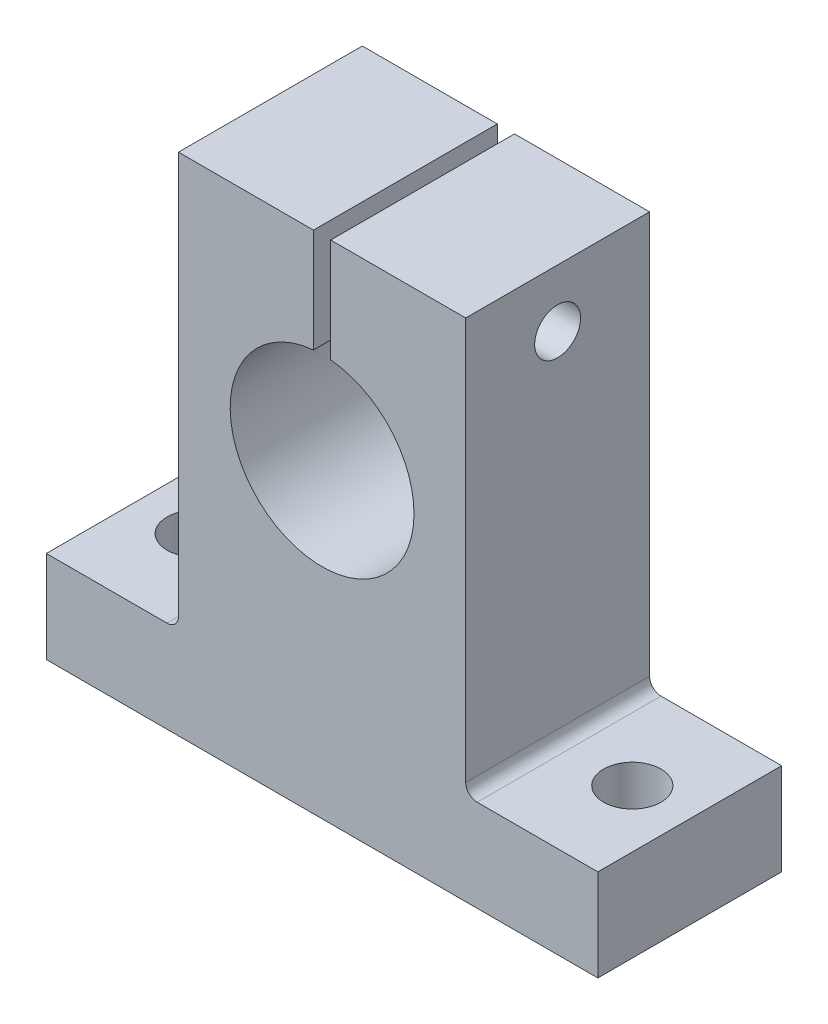
ISO-10303-21;
HEADER;
FILE_DESCRIPTION(('STEP AP214'),'2;1');
FILE_NAME('part.step','',(''),(''),'','','');
FILE_SCHEMA(('AUTOMOTIVE_DESIGN { 1 0 10303 214 1 1 1 1 }'));
ENDSEC;
DATA;
#1=APPLICATION_CONTEXT('core data for automotive mechanical design processes');
#2=APPLICATION_PROTOCOL_DEFINITION('international standard','automotive_design',2000,#1);
#3=PRODUCT_CONTEXT('',#1,'mechanical');
#4=PRODUCT('Part','Part','',(#3));
#5=PRODUCT_RELATED_PRODUCT_CATEGORY('part','',(#4));
#6=PRODUCT_DEFINITION_FORMATION('','',#4);
#7=PRODUCT_DEFINITION_CONTEXT('part definition',#1,'design');
#8=PRODUCT_DEFINITION('design','',#6,#7);
#9=PRODUCT_DEFINITION_SHAPE('','',#8);
#10=(LENGTH_UNIT() NAMED_UNIT(*) SI_UNIT(.MILLI.,.METRE.));
#11=(NAMED_UNIT(*) PLANE_ANGLE_UNIT() SI_UNIT($,.RADIAN.));
#12=(NAMED_UNIT(*) SI_UNIT($,.STERADIAN.) SOLID_ANGLE_UNIT());
#13=UNCERTAINTY_MEASURE_WITH_UNIT(LENGTH_MEASURE(1.E-05),#10,'distance_accuracy_value','');
#14=(GEOMETRIC_REPRESENTATION_CONTEXT(3) GLOBAL_UNCERTAINTY_ASSIGNED_CONTEXT((#13)) GLOBAL_UNIT_ASSIGNED_CONTEXT((#10,
#11,#12)) REPRESENTATION_CONTEXT('',''));
#15=CARTESIAN_POINT('',(0.,0.,0.));
#16=DIRECTION('',(0.,0.,1.));
#17=DIRECTION('',(1.,0.,0.));
#18=AXIS2_PLACEMENT_3D('',#15,#16,#17);
#19=CARTESIAN_POINT('',(24.,39.,0.));
#20=DIRECTION('',(-1.,0.,0.));
#21=DIRECTION('',(0.,-1.,0.));
#22=AXIS2_PLACEMENT_3D('',#19,#20,#21);
#23=CYLINDRICAL_SURFACE('',#22,2.);
#24=CARTESIAN_POINT('',(-0.750000000000001,39.,0.));
#25=DIRECTION('',(-1.,0.,0.));
#26=DIRECTION('',(0.,-1.,0.));
#27=AXIS2_PLACEMENT_3D('',#24,#25,#26);
#28=CIRCLE('',#27,2.);
#29=CARTESIAN_POINT('',(-0.750000000000001,37.,0.));
#30=VERTEX_POINT('',#29);
#31=EDGE_CURVE('E375',#30,#30,#28,.T.);
#32=ORIENTED_EDGE('',*,*,#31,.F.);
#33=EDGE_LOOP('',(#32));
#34=FACE_BOUND('',#33,.T.);
#35=CARTESIAN_POINT('',(-8.5,39.,0.));
#36=DIRECTION('',(-1.,0.,0.));
#37=DIRECTION('',(0.,-1.,0.));
#38=AXIS2_PLACEMENT_3D('',#35,#36,#37);
#39=CIRCLE('',#38,2.);
#40=CARTESIAN_POINT('',(-8.5,37.,0.));
#41=VERTEX_POINT('',#40);
#42=EDGE_CURVE('E36',#41,#41,#39,.F.);
#43=ORIENTED_EDGE('',*,*,#42,.F.);
#44=EDGE_LOOP('',(#43));
#45=FACE_BOUND('',#44,.T.);
#46=ADVANCED_FACE('F32',(#34,#45),#23,.F.);
#47=CARTESIAN_POINT('',(-24.,8.,8.));
#48=DIRECTION('',(1.,0.,0.));
#49=DIRECTION('',(0.,0.,-1.));
#50=AXIS2_PLACEMENT_3D('',#47,#48,#49);
#51=PLANE('',#50);
#52=DIRECTION('',(0.,-1.,0.));
#53=VECTOR('',#52,1.);
#54=CARTESIAN_POINT('',(-24.,8.,-8.));
#55=LINE('',#54,#53);
#56=CARTESIAN_POINT('',(-24.,8.,-8.));
#57=VERTEX_POINT('',#56);
#58=CARTESIAN_POINT('',(-24.,0.,-8.));
#59=VERTEX_POINT('',#58);
#60=EDGE_CURVE('E158',#57,#59,#55,.T.);
#61=ORIENTED_EDGE('',*,*,#60,.T.);
#62=DIRECTION('',(0.,0.,-1.));
#63=VECTOR('',#62,1.);
#64=CARTESIAN_POINT('',(-24.,0.,8.));
#65=LINE('',#64,#63);
#66=CARTESIAN_POINT('',(-24.,0.,8.));
#67=VERTEX_POINT('',#66);
#68=EDGE_CURVE('E138',#67,#59,#65,.T.);
#69=ORIENTED_EDGE('',*,*,#68,.F.);
#70=DIRECTION('',(0.,-1.,0.));
#71=VECTOR('',#70,1.);
#72=CARTESIAN_POINT('',(-24.,8.,8.));
#73=LINE('',#72,#71);
#74=CARTESIAN_POINT('',(-24.,8.,8.));
#75=VERTEX_POINT('',#74);
#76=EDGE_CURVE('E145',#75,#67,#73,.T.);
#77=ORIENTED_EDGE('',*,*,#76,.F.);
#78=DIRECTION('',(0.,0.,-1.));
#79=VECTOR('',#78,1.);
#80=CARTESIAN_POINT('',(-24.,8.,8.));
#81=LINE('',#80,#79);
#82=EDGE_CURVE('E187',#75,#57,#81,.T.);
#83=ORIENTED_EDGE('',*,*,#82,.T.);
#84=EDGE_LOOP('',(#61,#69,#77,#83));
#85=FACE_BOUND('',#84,.T.);
#86=ADVANCED_FACE('F156',(#85),#51,.F.);
#87=CARTESIAN_POINT('',(-24.,0.,8.));
#88=DIRECTION('',(0.,1.,0.));
#89=DIRECTION('',(0.,0.,1.));
#90=AXIS2_PLACEMENT_3D('',#87,#88,#89);
#91=PLANE('',#90);
#92=CARTESIAN_POINT('',(19.,0.,0.));
#93=DIRECTION('',(0.,1.,0.));
#94=DIRECTION('',(-1.,0.,0.));
#95=AXIS2_PLACEMENT_3D('',#92,#93,#94);
#96=CIRCLE('',#95,2.5);
#97=CARTESIAN_POINT('',(16.5,0.,0.));
#98=VERTEX_POINT('',#97);
#99=EDGE_CURVE('E357',#98,#98,#96,.T.);
#100=ORIENTED_EDGE('',*,*,#99,.T.);
#101=EDGE_LOOP('',(#100));
#102=FACE_BOUND('',#101,.T.);
#103=CARTESIAN_POINT('',(-19.,0.,0.));
#104=DIRECTION('',(0.,1.,0.));
#105=DIRECTION('',(-1.,0.,0.));
#106=AXIS2_PLACEMENT_3D('',#103,#104,#105);
#107=CIRCLE('',#106,2.5);
#108=CARTESIAN_POINT('',(-21.5,0.,0.));
#109=VERTEX_POINT('',#108);
#110=EDGE_CURVE('E261',#109,#109,#107,.T.);
#111=ORIENTED_EDGE('',*,*,#110,.T.);
#112=EDGE_LOOP('',(#111));
#113=FACE_BOUND('',#112,.T.);
#114=DIRECTION('',(1.,0.,0.));
#115=VECTOR('',#114,1.);
#116=CARTESIAN_POINT('',(-24.,0.,-8.));
#117=LINE('',#116,#115);
#118=CARTESIAN_POINT('',(24.,0.,-8.));
#119=VERTEX_POINT('',#118);
#120=EDGE_CURVE('E235',#59,#119,#117,.T.);
#121=ORIENTED_EDGE('',*,*,#120,.T.);
#122=DIRECTION('',(0.,0.,-1.));
#123=VECTOR('',#122,1.);
#124=CARTESIAN_POINT('',(24.,0.,8.));
#125=LINE('',#124,#123);
#126=CARTESIAN_POINT('',(24.,0.,8.));
#127=VERTEX_POINT('',#126);
#128=EDGE_CURVE('E141',#127,#119,#125,.T.);
#129=ORIENTED_EDGE('',*,*,#128,.F.);
#130=DIRECTION('',(1.,0.,0.));
#131=VECTOR('',#130,1.);
#132=CARTESIAN_POINT('',(-24.,0.,8.));
#133=LINE('',#132,#131);
#134=EDGE_CURVE('E134',#67,#127,#133,.T.);
#135=ORIENTED_EDGE('',*,*,#134,.F.);
#136=ORIENTED_EDGE('',*,*,#68,.T.);
#137=EDGE_LOOP('',(#121,#129,#135,#136));
#138=FACE_BOUND('',#137,.T.);
#139=ADVANCED_FACE('F136',(#102,#113,#138),#91,.F.);
#140=CARTESIAN_POINT('',(24.,0.,8.));
#141=DIRECTION('',(-1.,0.,0.));
#142=DIRECTION('',(0.,0.,1.));
#143=AXIS2_PLACEMENT_3D('',#140,#141,#142);
#144=PLANE('',#143);
#145=DIRECTION('',(0.,1.,0.));
#146=VECTOR('',#145,1.);
#147=CARTESIAN_POINT('',(24.,0.,-8.));
#148=LINE('',#147,#146);
#149=CARTESIAN_POINT('',(24.,8.,-8.));
#150=VERTEX_POINT('',#149);
#151=EDGE_CURVE('E230',#119,#150,#148,.T.);
#152=ORIENTED_EDGE('',*,*,#151,.T.);
#153=DIRECTION('',(0.,0.,-1.));
#154=VECTOR('',#153,1.);
#155=CARTESIAN_POINT('',(24.,8.,8.));
#156=LINE('',#155,#154);
#157=CARTESIAN_POINT('',(24.,8.,8.));
#158=VERTEX_POINT('',#157);
#159=EDGE_CURVE('E164',#158,#150,#156,.T.);
#160=ORIENTED_EDGE('',*,*,#159,.F.);
#161=DIRECTION('',(0.,1.,0.));
#162=VECTOR('',#161,1.);
#163=CARTESIAN_POINT('',(24.,0.,8.));
#164=LINE('',#163,#162);
#165=EDGE_CURVE('E144',#127,#158,#164,.T.);
#166=ORIENTED_EDGE('',*,*,#165,.F.);
#167=ORIENTED_EDGE('',*,*,#128,.T.);
#168=EDGE_LOOP('',(#152,#160,#166,#167));
#169=FACE_BOUND('',#168,.T.);
#170=ADVANCED_FACE('F262',(#169),#144,.F.);
#171=CARTESIAN_POINT('',(24.,8.,8.));
#172=DIRECTION('',(0.,-1.,0.));
#173=DIRECTION('',(1.,0.,0.));
#174=AXIS2_PLACEMENT_3D('',#171,#172,#173);
#175=PLANE('',#174);
#176=CARTESIAN_POINT('',(19.,8.00000000000001,0.));
#177=DIRECTION('',(0.,1.,0.));
#178=DIRECTION('',(-1.,0.,0.));
#179=AXIS2_PLACEMENT_3D('',#176,#177,#178);
#180=CIRCLE('',#179,2.5);
#181=CARTESIAN_POINT('',(16.5,8.00000000000001,0.));
#182=VERTEX_POINT('',#181);
#183=EDGE_CURVE('E365',#182,#182,#180,.T.);
#184=ORIENTED_EDGE('',*,*,#183,.F.);
#185=EDGE_LOOP('',(#184));
#186=FACE_BOUND('',#185,.T.);
#187=DIRECTION('',(-1.,0.,0.));
#188=VECTOR('',#187,1.);
#189=CARTESIAN_POINT('',(24.,8.,-8.));
#190=LINE('',#189,#188);
#191=CARTESIAN_POINT('',(13.5,8.,-8.));
#192=VERTEX_POINT('',#191);
#193=EDGE_CURVE('E226',#150,#192,#190,.T.);
#194=ORIENTED_EDGE('',*,*,#193,.T.);
#195=DIRECTION('',(0.,0.,-1.));
#196=VECTOR('',#195,1.);
#197=CARTESIAN_POINT('',(13.5,8.,8.));
#198=LINE('',#197,#196);
#199=CARTESIAN_POINT('',(13.5,8.,8.));
#200=VERTEX_POINT('',#199);
#201=EDGE_CURVE('E48',#192,#200,#198,.F.);
#202=ORIENTED_EDGE('',*,*,#201,.T.);
#203=DIRECTION('',(-1.,0.,0.));
#204=VECTOR('',#203,1.);
#205=CARTESIAN_POINT('',(24.,8.,8.));
#206=LINE('',#205,#204);
#207=EDGE_CURVE('E227',#158,#200,#206,.T.);
#208=ORIENTED_EDGE('',*,*,#207,.F.);
#209=ORIENTED_EDGE('',*,*,#159,.T.);
#210=EDGE_LOOP('',(#194,#202,#208,#209));
#211=FACE_BOUND('',#210,.T.);
#212=ADVANCED_FACE('F225',(#186,#211),#175,.F.);
#213=CARTESIAN_POINT('',(12.5,8.,8.));
#214=DIRECTION('',(-1.,0.,0.));
#215=DIRECTION('',(0.,-1.,0.));
#216=AXIS2_PLACEMENT_3D('',#213,#214,#215);
#217=PLANE('',#216);
#218=CARTESIAN_POINT('',(12.5,39.,0.));
#219=DIRECTION('',(-1.,0.,0.));
#220=DIRECTION('',(0.,-1.,0.));
#221=AXIS2_PLACEMENT_3D('',#218,#219,#220);
#222=CIRCLE('',#221,2.);
#223=CARTESIAN_POINT('',(12.5,37.,0.));
#224=VERTEX_POINT('',#223);
#225=EDGE_CURVE('E368',#224,#224,#222,.T.);
#226=ORIENTED_EDGE('',*,*,#225,.T.);
#227=EDGE_LOOP('',(#226));
#228=FACE_BOUND('',#227,.T.);
#229=DIRECTION('',(0.,1.,0.));
#230=VECTOR('',#229,1.);
#231=CARTESIAN_POINT('',(12.5,8.,8.));
#232=LINE('',#231,#230);
#233=CARTESIAN_POINT('',(12.5,9.,8.));
#234=VERTEX_POINT('',#233);
#235=CARTESIAN_POINT('',(12.5,44.,8.));
#236=VERTEX_POINT('',#235);
#237=EDGE_CURVE('E264',#234,#236,#232,.T.);
#238=ORIENTED_EDGE('',*,*,#237,.F.);
#239=DIRECTION('',(0.,0.,-1.));
#240=VECTOR('',#239,1.);
#241=CARTESIAN_POINT('',(12.5,9.,-8.));
#242=LINE('',#241,#240);
#243=CARTESIAN_POINT('',(12.5,9.,-8.));
#244=VERTEX_POINT('',#243);
#245=EDGE_CURVE('E169',#234,#244,#242,.T.);
#246=ORIENTED_EDGE('',*,*,#245,.T.);
#247=DIRECTION('',(0.,1.,0.));
#248=VECTOR('',#247,1.);
#249=CARTESIAN_POINT('',(12.5,8.,-8.));
#250=LINE('',#249,#248);
#251=CARTESIAN_POINT('',(12.5,44.,-8.));
#252=VERTEX_POINT('',#251);
#253=EDGE_CURVE('E231',#244,#252,#250,.T.);
#254=ORIENTED_EDGE('',*,*,#253,.T.);
#255=DIRECTION('',(0.,0.,-1.));
#256=VECTOR('',#255,1.);
#257=CARTESIAN_POINT('',(12.5,44.,8.));
#258=LINE('',#257,#256);
#259=EDGE_CURVE('E221',#236,#252,#258,.T.);
#260=ORIENTED_EDGE('',*,*,#259,.F.);
#261=EDGE_LOOP('',(#238,#246,#254,#260));
#262=FACE_BOUND('',#261,.T.);
#263=ADVANCED_FACE('F287',(#228,#262),#217,.F.);
#264=CARTESIAN_POINT('',(12.5,44.,8.));
#265=DIRECTION('',(0.,-1.,0.));
#266=DIRECTION('',(0.,0.,-1.));
#267=AXIS2_PLACEMENT_3D('',#264,#265,#266);
#268=PLANE('',#267);
#269=DIRECTION('',(-1.,0.,0.));
#270=VECTOR('',#269,1.);
#271=CARTESIAN_POINT('',(12.5,44.,-8.));
#272=LINE('',#271,#270);
#273=CARTESIAN_POINT('',(0.75,44.,-8.));
#274=VERTEX_POINT('',#273);
#275=EDGE_CURVE('E233',#252,#274,#272,.T.);
#276=ORIENTED_EDGE('',*,*,#275,.T.);
#277=DIRECTION('',(0.,0.,-1.));
#278=VECTOR('',#277,1.);
#279=CARTESIAN_POINT('',(0.75,44.,8.));
#280=LINE('',#279,#278);
#281=CARTESIAN_POINT('',(0.75,44.,8.));
#282=VERTEX_POINT('',#281);
#283=EDGE_CURVE('E218',#282,#274,#280,.T.);
#284=ORIENTED_EDGE('',*,*,#283,.F.);
#285=DIRECTION('',(-1.,0.,0.));
#286=VECTOR('',#285,1.);
#287=CARTESIAN_POINT('',(12.5,44.,8.));
#288=LINE('',#287,#286);
#289=EDGE_CURVE('E268',#236,#282,#288,.T.);
#290=ORIENTED_EDGE('',*,*,#289,.F.);
#291=ORIENTED_EDGE('',*,*,#259,.T.);
#292=EDGE_LOOP('',(#276,#284,#290,#291));
#293=FACE_BOUND('',#292,.T.);
#294=ADVANCED_FACE('F283',(#293),#268,.F.);
#295=CARTESIAN_POINT('',(0.75,44.,8.));
#296=DIRECTION('',(1.,0.,0.));
#297=DIRECTION('',(0.,1.,0.));
#298=AXIS2_PLACEMENT_3D('',#295,#296,#297);
#299=PLANE('',#298);
#300=CARTESIAN_POINT('',(0.750000000000001,39.,0.));
#301=DIRECTION('',(1.,0.,0.));
#302=DIRECTION('',(0.,1.,0.));
#303=AXIS2_PLACEMENT_3D('',#300,#301,#302);
#304=CIRCLE('',#303,2.);
#305=CARTESIAN_POINT('',(0.75,41.,0.));
#306=VERTEX_POINT('',#305);
#307=EDGE_CURVE('E372',#306,#306,#304,.T.);
#308=ORIENTED_EDGE('',*,*,#307,.T.);
#309=EDGE_LOOP('',(#308));
#310=FACE_BOUND('',#309,.T.);
#311=DIRECTION('',(0.,-1.,0.));
#312=VECTOR('',#311,1.);
#313=CARTESIAN_POINT('',(0.75,44.,-8.));
#314=LINE('',#313,#312);
#315=CARTESIAN_POINT('',(0.750000000000001,34.964766161037,-8.));
#316=VERTEX_POINT('',#315);
#317=EDGE_CURVE('E240',#274,#316,#314,.T.);
#318=ORIENTED_EDGE('',*,*,#317,.T.);
#319=DIRECTION('',(0.,0.,-1.));
#320=VECTOR('',#319,1.);
#321=CARTESIAN_POINT('',(0.750000000000001,34.964766161037,8.));
#322=LINE('',#321,#320);
#323=CARTESIAN_POINT('',(0.750000000000001,34.964766161037,8.));
#324=VERTEX_POINT('',#323);
#325=EDGE_CURVE('E215',#324,#316,#322,.T.);
#326=ORIENTED_EDGE('',*,*,#325,.F.);
#327=DIRECTION('',(0.,-1.,0.));
#328=VECTOR('',#327,1.);
#329=CARTESIAN_POINT('',(0.75,44.,8.));
#330=LINE('',#329,#328);
#331=EDGE_CURVE('E270',#282,#324,#330,.T.);
#332=ORIENTED_EDGE('',*,*,#331,.F.);
#333=ORIENTED_EDGE('',*,*,#283,.T.);
#334=EDGE_LOOP('',(#318,#326,#332,#333));
#335=FACE_BOUND('',#334,.T.);
#336=ADVANCED_FACE('F279',(#310,#335),#299,.F.);
#337=CARTESIAN_POINT('',(0.,27.,8.));
#338=DIRECTION('',(0.,0.,-1.));
#339=DIRECTION('',(-1.,0.,0.));
#340=AXIS2_PLACEMENT_3D('',#337,#338,#339);
#341=CYLINDRICAL_SURFACE('',#340,8.);
#342=CARTESIAN_POINT('',(0.,27.,-8.));
#343=DIRECTION('',(0.,0.,-1.));
#344=DIRECTION('',(1.,0.,0.));
#345=AXIS2_PLACEMENT_3D('',#342,#343,#344);
#346=CIRCLE('',#345,8.);
#347=CARTESIAN_POINT('',(-0.750000000000002,34.964766161037,-8.));
#348=VERTEX_POINT('',#347);
#349=EDGE_CURVE('E242',#316,#348,#346,.T.);
#350=ORIENTED_EDGE('',*,*,#349,.T.);
#351=DIRECTION('',(0.,0.,-1.));
#352=VECTOR('',#351,1.);
#353=CARTESIAN_POINT('',(-0.750000000000002,34.964766161037,8.));
#354=LINE('',#353,#352);
#355=CARTESIAN_POINT('',(-0.750000000000002,34.964766161037,8.));
#356=VERTEX_POINT('',#355);
#357=EDGE_CURVE('E212',#356,#348,#354,.T.);
#358=ORIENTED_EDGE('',*,*,#357,.F.);
#359=CARTESIAN_POINT('',(0.,27.,8.));
#360=DIRECTION('',(0.,0.,-1.));
#361=DIRECTION('',(1.,0.,0.));
#362=AXIS2_PLACEMENT_3D('',#359,#360,#361);
#363=CIRCLE('',#362,8.);
#364=EDGE_CURVE('E257',#324,#356,#363,.T.);
#365=ORIENTED_EDGE('',*,*,#364,.F.);
#366=ORIENTED_EDGE('',*,*,#325,.T.);
#367=EDGE_LOOP('',(#350,#358,#365,#366));
#368=FACE_BOUND('',#367,.T.);
#369=ADVANCED_FACE('F275',(#368),#341,.F.);
#370=CARTESIAN_POINT('',(-0.75,44.,8.));
#371=DIRECTION('',(-1.,0.,0.));
#372=DIRECTION('',(0.,-1.,0.));
#373=AXIS2_PLACEMENT_3D('',#370,#371,#372);
#374=PLANE('',#373);
#375=ORIENTED_EDGE('',*,*,#31,.T.);
#376=EDGE_LOOP('',(#375));
#377=FACE_BOUND('',#376,.T.);
#378=DIRECTION('',(0.,1.,0.));
#379=VECTOR('',#378,1.);
#380=CARTESIAN_POINT('',(-0.75,44.,-8.));
#381=LINE('',#380,#379);
#382=CARTESIAN_POINT('',(-0.75,44.,-8.));
#383=VERTEX_POINT('',#382);
#384=EDGE_CURVE('E203',#348,#383,#381,.T.);
#385=ORIENTED_EDGE('',*,*,#384,.T.);
#386=DIRECTION('',(0.,0.,-1.));
#387=VECTOR('',#386,1.);
#388=CARTESIAN_POINT('',(-0.75,44.,8.));
#389=LINE('',#388,#387);
#390=CARTESIAN_POINT('',(-0.75,44.,8.));
#391=VERTEX_POINT('',#390);
#392=EDGE_CURVE('E209',#391,#383,#389,.T.);
#393=ORIENTED_EDGE('',*,*,#392,.F.);
#394=DIRECTION('',(0.,1.,0.));
#395=VECTOR('',#394,1.);
#396=CARTESIAN_POINT('',(-0.75,44.,8.));
#397=LINE('',#396,#395);
#398=EDGE_CURVE('E254',#356,#391,#397,.T.);
#399=ORIENTED_EDGE('',*,*,#398,.F.);
#400=ORIENTED_EDGE('',*,*,#357,.T.);
#401=EDGE_LOOP('',(#385,#393,#399,#400));
#402=FACE_BOUND('',#401,.T.);
#403=ADVANCED_FACE('F246',(#377,#402),#374,.F.);
#404=CARTESIAN_POINT('',(-0.75,44.,8.));
#405=DIRECTION('',(0.,-1.,0.));
#406=DIRECTION('',(0.,0.,-1.));
#407=AXIS2_PLACEMENT_3D('',#404,#405,#406);
#408=PLANE('',#407);
#409=DIRECTION('',(-1.,0.,0.));
#410=VECTOR('',#409,1.);
#411=CARTESIAN_POINT('',(-0.75,44.,-8.));
#412=LINE('',#411,#410);
#413=CARTESIAN_POINT('',(-12.5,44.,-8.));
#414=VERTEX_POINT('',#413);
#415=EDGE_CURVE('E200',#383,#414,#412,.T.);
#416=ORIENTED_EDGE('',*,*,#415,.T.);
#417=DIRECTION('',(0.,0.,-1.));
#418=VECTOR('',#417,1.);
#419=CARTESIAN_POINT('',(-12.5,44.,8.));
#420=LINE('',#419,#418);
#421=CARTESIAN_POINT('',(-12.5,44.,8.));
#422=VERTEX_POINT('',#421);
#423=EDGE_CURVE('E199',#422,#414,#420,.T.);
#424=ORIENTED_EDGE('',*,*,#423,.F.);
#425=DIRECTION('',(-1.,0.,0.));
#426=VECTOR('',#425,1.);
#427=CARTESIAN_POINT('',(-0.75,44.,8.));
#428=LINE('',#427,#426);
#429=EDGE_CURVE('E253',#391,#422,#428,.T.);
#430=ORIENTED_EDGE('',*,*,#429,.F.);
#431=ORIENTED_EDGE('',*,*,#392,.T.);
#432=EDGE_LOOP('',(#416,#424,#430,#431));
#433=FACE_BOUND('',#432,.T.);
#434=ADVANCED_FACE('F252',(#433),#408,.F.);
#435=CARTESIAN_POINT('',(-12.5,44.,8.));
#436=DIRECTION('',(1.,0.,0.));
#437=DIRECTION('',(0.,1.,0.));
#438=AXIS2_PLACEMENT_3D('',#435,#436,#437);
#439=PLANE('',#438);
#440=CARTESIAN_POINT('',(-12.5,39.,0.));
#441=DIRECTION('',(-1.,0.,0.));
#442=DIRECTION('',(0.,-1.,0.));
#443=AXIS2_PLACEMENT_3D('',#440,#441,#442);
#444=CIRCLE('',#443,3.5);
#445=CARTESIAN_POINT('',(-12.5,35.5,0.));
#446=VERTEX_POINT('',#445);
#447=EDGE_CURVE('E378',#446,#446,#444,.T.);
#448=ORIENTED_EDGE('',*,*,#447,.F.);
#449=EDGE_LOOP('',(#448));
#450=FACE_BOUND('',#449,.T.);
#451=DIRECTION('',(0.,-1.,0.));
#452=VECTOR('',#451,1.);
#453=CARTESIAN_POINT('',(-12.5,44.,-8.));
#454=LINE('',#453,#452);
#455=CARTESIAN_POINT('',(-12.5,9.,-8.));
#456=VERTEX_POINT('',#455);
#457=EDGE_CURVE('E194',#414,#456,#454,.T.);
#458=ORIENTED_EDGE('',*,*,#457,.T.);
#459=DIRECTION('',(0.,0.,-1.));
#460=VECTOR('',#459,1.);
#461=CARTESIAN_POINT('',(-12.5,9.,8.));
#462=LINE('',#461,#460);
#463=CARTESIAN_POINT('',(-12.5,9.,8.));
#464=VERTEX_POINT('',#463);
#465=EDGE_CURVE('E162',#456,#464,#462,.F.);
#466=ORIENTED_EDGE('',*,*,#465,.T.);
#467=DIRECTION('',(0.,-1.,0.));
#468=VECTOR('',#467,1.);
#469=CARTESIAN_POINT('',(-12.5,44.,8.));
#470=LINE('',#469,#468);
#471=EDGE_CURVE('E180',#422,#464,#470,.T.);
#472=ORIENTED_EDGE('',*,*,#471,.F.);
#473=ORIENTED_EDGE('',*,*,#423,.T.);
#474=EDGE_LOOP('',(#458,#466,#472,#473));
#475=FACE_BOUND('',#474,.T.);
#476=ADVANCED_FACE('F197',(#450,#475),#439,.F.);
#477=CARTESIAN_POINT('',(-12.5,8.,8.));
#478=DIRECTION('',(0.,-1.,0.));
#479=DIRECTION('',(1.,0.,0.));
#480=AXIS2_PLACEMENT_3D('',#477,#478,#479);
#481=PLANE('',#480);
#482=CARTESIAN_POINT('',(-19.,8.,0.));
#483=DIRECTION('',(0.,1.,0.));
#484=DIRECTION('',(-1.,0.,0.));
#485=AXIS2_PLACEMENT_3D('',#482,#483,#484);
#486=CIRCLE('',#485,2.5);
#487=CARTESIAN_POINT('',(-21.5,8.,0.));
#488=VERTEX_POINT('',#487);
#489=EDGE_CURVE('E360',#488,#488,#486,.T.);
#490=ORIENTED_EDGE('',*,*,#489,.F.);
#491=EDGE_LOOP('',(#490));
#492=FACE_BOUND('',#491,.T.);
#493=DIRECTION('',(-1.,0.,0.));
#494=VECTOR('',#493,1.);
#495=CARTESIAN_POINT('',(-12.5,8.,8.));
#496=LINE('',#495,#494);
#497=CARTESIAN_POINT('',(-13.5,8.,8.));
#498=VERTEX_POINT('',#497);
#499=EDGE_CURVE('E150',#498,#75,#496,.T.);
#500=ORIENTED_EDGE('',*,*,#499,.F.);
#501=DIRECTION('',(0.,0.,-1.));
#502=VECTOR('',#501,1.);
#503=CARTESIAN_POINT('',(-13.5,8.,-8.));
#504=LINE('',#503,#502);
#505=CARTESIAN_POINT('',(-13.5,8.,-8.));
#506=VERTEX_POINT('',#505);
#507=EDGE_CURVE('E159',#498,#506,#504,.T.);
#508=ORIENTED_EDGE('',*,*,#507,.T.);
#509=DIRECTION('',(-1.,0.,0.));
#510=VECTOR('',#509,1.);
#511=CARTESIAN_POINT('',(-12.5,8.,-8.));
#512=LINE('',#511,#510);
#513=EDGE_CURVE('E154',#506,#57,#512,.T.);
#514=ORIENTED_EDGE('',*,*,#513,.T.);
#515=ORIENTED_EDGE('',*,*,#82,.F.);
#516=EDGE_LOOP('',(#500,#508,#514,#515));
#517=FACE_BOUND('',#516,.T.);
#518=ADVANCED_FACE('F185',(#492,#517),#481,.F.);
#519=CARTESIAN_POINT('',(0.,27.,8.));
#520=DIRECTION('',(0.,0.,1.));
#521=DIRECTION('',(1.,0.,0.));
#522=AXIS2_PLACEMENT_3D('',#519,#520,#521);
#523=PLANE('',#522);
#524=ORIENTED_EDGE('',*,*,#76,.T.);
#525=ORIENTED_EDGE('',*,*,#134,.T.);
#526=ORIENTED_EDGE('',*,*,#165,.T.);
#527=ORIENTED_EDGE('',*,*,#207,.T.);
#528=CARTESIAN_POINT('',(13.5,9.,8.));
#529=DIRECTION('',(0.,0.,1.));
#530=DIRECTION('',(1.,0.,0.));
#531=AXIS2_PLACEMENT_3D('',#528,#529,#530);
#532=CIRCLE('',#531,1.);
#533=EDGE_CURVE('E11',#200,#234,#532,.F.);
#534=ORIENTED_EDGE('',*,*,#533,.T.);
#535=ORIENTED_EDGE('',*,*,#237,.T.);
#536=ORIENTED_EDGE('',*,*,#289,.T.);
#537=ORIENTED_EDGE('',*,*,#331,.T.);
#538=ORIENTED_EDGE('',*,*,#364,.T.);
#539=ORIENTED_EDGE('',*,*,#398,.T.);
#540=ORIENTED_EDGE('',*,*,#429,.T.);
#541=ORIENTED_EDGE('',*,*,#471,.T.);
#542=CARTESIAN_POINT('',(-13.5,9.,8.));
#543=DIRECTION('',(0.,0.,1.));
#544=DIRECTION('',(1.,0.,0.));
#545=AXIS2_PLACEMENT_3D('',#542,#543,#544);
#546=CIRCLE('',#545,1.);
#547=EDGE_CURVE('E175',#464,#498,#546,.F.);
#548=ORIENTED_EDGE('',*,*,#547,.T.);
#549=ORIENTED_EDGE('',*,*,#499,.T.);
#550=EDGE_LOOP('',(#524,#525,#526,#527,#534,#535,#536,#537,#538,#539,#540,#541,#548,#549));
#551=FACE_BOUND('',#550,.T.);
#552=ADVANCED_FACE('F148',(#551),#523,.T.);
#553=CARTESIAN_POINT('',(0.,27.,-8.));
#554=DIRECTION('',(0.,0.,1.));
#555=DIRECTION('',(1.,0.,0.));
#556=AXIS2_PLACEMENT_3D('',#553,#554,#555);
#557=PLANE('',#556);
#558=ORIENTED_EDGE('',*,*,#60,.F.);
#559=ORIENTED_EDGE('',*,*,#513,.F.);
#560=CARTESIAN_POINT('',(-13.5,9.,-8.));
#561=DIRECTION('',(0.,0.,1.));
#562=DIRECTION('',(1.,0.,0.));
#563=AXIS2_PLACEMENT_3D('',#560,#561,#562);
#564=CIRCLE('',#563,1.);
#565=EDGE_CURVE('E173',#506,#456,#564,.T.);
#566=ORIENTED_EDGE('',*,*,#565,.T.);
#567=ORIENTED_EDGE('',*,*,#457,.F.);
#568=ORIENTED_EDGE('',*,*,#415,.F.);
#569=ORIENTED_EDGE('',*,*,#384,.F.);
#570=ORIENTED_EDGE('',*,*,#349,.F.);
#571=ORIENTED_EDGE('',*,*,#317,.F.);
#572=ORIENTED_EDGE('',*,*,#275,.F.);
#573=ORIENTED_EDGE('',*,*,#253,.F.);
#574=CARTESIAN_POINT('',(13.5,9.,-8.));
#575=DIRECTION('',(0.,0.,1.));
#576=DIRECTION('',(1.,0.,0.));
#577=AXIS2_PLACEMENT_3D('',#574,#575,#576);
#578=CIRCLE('',#577,1.);
#579=EDGE_CURVE('E41',#244,#192,#578,.T.);
#580=ORIENTED_EDGE('',*,*,#579,.T.);
#581=ORIENTED_EDGE('',*,*,#193,.F.);
#582=ORIENTED_EDGE('',*,*,#151,.F.);
#583=ORIENTED_EDGE('',*,*,#120,.F.);
#584=EDGE_LOOP('',(#558,#559,#566,#567,#568,#569,#570,#571,#572,#573,#580,#581,#582,#583));
#585=FACE_BOUND('',#584,.T.);
#586=ADVANCED_FACE('F192',(#585),#557,.F.);
#587=CARTESIAN_POINT('',(-19.,0.,0.));
#588=DIRECTION('',(0.,1.,0.));
#589=DIRECTION('',(-1.,0.,0.));
#590=AXIS2_PLACEMENT_3D('',#587,#588,#589);
#591=CYLINDRICAL_SURFACE('',#590,2.5);
#592=ORIENTED_EDGE('',*,*,#110,.F.);
#593=EDGE_LOOP('',(#592));
#594=FACE_BOUND('',#593,.T.);
#595=ORIENTED_EDGE('',*,*,#489,.T.);
#596=EDGE_LOOP('',(#595));
#597=FACE_BOUND('',#596,.T.);
#598=ADVANCED_FACE('F315',(#594,#597),#591,.F.);
#599=CARTESIAN_POINT('',(19.,0.,0.));
#600=DIRECTION('',(0.,1.,0.));
#601=DIRECTION('',(-1.,0.,0.));
#602=AXIS2_PLACEMENT_3D('',#599,#600,#601);
#603=CYLINDRICAL_SURFACE('',#602,2.5);
#604=ORIENTED_EDGE('',*,*,#99,.F.);
#605=EDGE_LOOP('',(#604));
#606=FACE_BOUND('',#605,.T.);
#607=ORIENTED_EDGE('',*,*,#183,.T.);
#608=EDGE_LOOP('',(#607));
#609=FACE_BOUND('',#608,.T.);
#610=ADVANCED_FACE('F300',(#606,#609),#603,.F.);
#611=CARTESIAN_POINT('',(-13.5,9.,8.));
#612=DIRECTION('',(0.,0.,1.));
#613=DIRECTION('',(1.,0.,0.));
#614=AXIS2_PLACEMENT_3D('',#611,#612,#613);
#615=CYLINDRICAL_SURFACE('',#614,1.);
#616=ORIENTED_EDGE('',*,*,#547,.F.);
#617=ORIENTED_EDGE('',*,*,#465,.F.);
#618=ORIENTED_EDGE('',*,*,#565,.F.);
#619=ORIENTED_EDGE('',*,*,#507,.F.);
#620=EDGE_LOOP('',(#616,#617,#618,#619));
#621=FACE_BOUND('',#620,.T.);
#622=ADVANCED_FACE('F189',(#621),#615,.F.);
#623=CARTESIAN_POINT('',(13.5,9.,8.));
#624=DIRECTION('',(0.,0.,1.));
#625=DIRECTION('',(1.,0.,0.));
#626=AXIS2_PLACEMENT_3D('',#623,#624,#625);
#627=CYLINDRICAL_SURFACE('',#626,1.);
#628=ORIENTED_EDGE('',*,*,#533,.F.);
#629=ORIENTED_EDGE('',*,*,#201,.F.);
#630=ORIENTED_EDGE('',*,*,#579,.F.);
#631=ORIENTED_EDGE('',*,*,#245,.F.);
#632=EDGE_LOOP('',(#628,#629,#630,#631));
#633=FACE_BOUND('',#632,.T.);
#634=ADVANCED_FACE('F34',(#633),#627,.F.);
#635=ORIENTED_EDGE('',*,*,#307,.F.);
#636=EDGE_LOOP('',(#635));
#637=FACE_BOUND('',#636,.T.);
#638=ORIENTED_EDGE('',*,*,#225,.F.);
#639=EDGE_LOOP('',(#638));
#640=FACE_BOUND('',#639,.T.);
#641=ADVANCED_FACE('F292',(#637,#640),#23,.F.);
#642=CARTESIAN_POINT('',(-8.5,39.,0.));
#643=DIRECTION('',(-1.,0.,0.));
#644=DIRECTION('',(0.,-1.,0.));
#645=AXIS2_PLACEMENT_3D('',#642,#643,#644);
#646=PLANE('',#645);
#647=CARTESIAN_POINT('',(-8.5,39.,0.));
#648=DIRECTION('',(-1.,0.,0.));
#649=DIRECTION('',(0.,-1.,0.));
#650=AXIS2_PLACEMENT_3D('',#647,#648,#649);
#651=CIRCLE('',#650,3.5);
#652=CARTESIAN_POINT('',(-8.5,35.5,0.));
#653=VERTEX_POINT('',#652);
#654=EDGE_CURVE('E381',#653,#653,#651,.T.);
#655=ORIENTED_EDGE('',*,*,#654,.T.);
#656=EDGE_LOOP('',(#655));
#657=FACE_BOUND('',#656,.T.);
#658=ORIENTED_EDGE('',*,*,#42,.T.);
#659=EDGE_LOOP('',(#658));
#660=FACE_BOUND('',#659,.T.);
#661=ADVANCED_FACE('F297',(#657,#660),#646,.T.);
#662=CARTESIAN_POINT('',(-8.5,39.,0.));
#663=DIRECTION('',(-1.,0.,0.));
#664=DIRECTION('',(0.,-1.,0.));
#665=AXIS2_PLACEMENT_3D('',#662,#663,#664);
#666=CYLINDRICAL_SURFACE('',#665,3.5);
#667=ORIENTED_EDGE('',*,*,#654,.F.);
#668=EDGE_LOOP('',(#667));
#669=FACE_BOUND('',#668,.T.);
#670=ORIENTED_EDGE('',*,*,#447,.T.);
#671=EDGE_LOOP('',(#670));
#672=FACE_BOUND('',#671,.T.);
#673=ADVANCED_FACE('F311',(#669,#672),#666,.F.);
#674=CLOSED_SHELL('',(#46,#86,#139,#170,#212,#263,#294,#336,#369,#403,#434,#476,#518,#552,#586,
#598,#610,#622,#634,#641,#661,#673));
#675=MANIFOLD_SOLID_BREP('B2',#674);
#676=ADVANCED_BREP_SHAPE_REPRESENTATION('',(#18,#675),#14);
#677=SHAPE_DEFINITION_REPRESENTATION(#9,#676);
ENDSEC;
END-ISO-10303-21;
